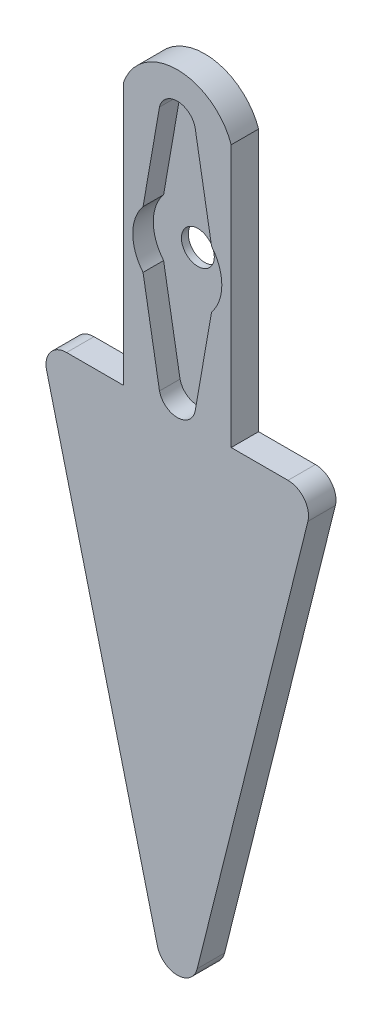
ISO-10303-21;
HEADER;
FILE_DESCRIPTION(('STEP AP214'),'2;1');
FILE_NAME('part.step','',(''),(''),'','','');
FILE_SCHEMA(('AUTOMOTIVE_DESIGN { 1 0 10303 214 1 1 1 1 }'));
ENDSEC;
DATA;
#1=APPLICATION_CONTEXT('core data for automotive mechanical design processes');
#2=APPLICATION_PROTOCOL_DEFINITION('international standard','automotive_design',2000,#1);
#3=PRODUCT_CONTEXT('',#1,'mechanical');
#4=PRODUCT('Part','Part','',(#3));
#5=PRODUCT_RELATED_PRODUCT_CATEGORY('part','',(#4));
#6=PRODUCT_DEFINITION_FORMATION('','',#4);
#7=PRODUCT_DEFINITION_CONTEXT('part definition',#1,'design');
#8=PRODUCT_DEFINITION('design','',#6,#7);
#9=PRODUCT_DEFINITION_SHAPE('','',#8);
#10=(LENGTH_UNIT() NAMED_UNIT(*) SI_UNIT(.MILLI.,.METRE.));
#11=(NAMED_UNIT(*) PLANE_ANGLE_UNIT() SI_UNIT($,.RADIAN.));
#12=(NAMED_UNIT(*) SI_UNIT($,.STERADIAN.) SOLID_ANGLE_UNIT());
#13=UNCERTAINTY_MEASURE_WITH_UNIT(LENGTH_MEASURE(1.E-05),#10,'distance_accuracy_value','');
#14=(GEOMETRIC_REPRESENTATION_CONTEXT(3) GLOBAL_UNCERTAINTY_ASSIGNED_CONTEXT((#13)) GLOBAL_UNIT_ASSIGNED_CONTEXT((#10,
#11,#12)) REPRESENTATION_CONTEXT('',''));
#15=CARTESIAN_POINT('',(0.,0.,0.));
#16=DIRECTION('',(0.,0.,1.));
#17=DIRECTION('',(1.,0.,0.));
#18=AXIS2_PLACEMENT_3D('',#15,#16,#17);
#19=CARTESIAN_POINT('',(0.,0.,4.));
#20=DIRECTION('',(0.,0.,-1.));
#21=DIRECTION('',(-1.,0.,0.));
#22=AXIS2_PLACEMENT_3D('',#19,#20,#21);
#23=CYLINDRICAL_SURFACE('',#22,6.5);
#24=DIRECTION('',(0.,0.,-1.));
#25=VECTOR('',#24,1.);
#26=CARTESIAN_POINT('',(4.99927103536296,4.15418934510465,4.));
#27=LINE('',#26,#25);
#28=CARTESIAN_POINT('',(4.99927103536296,4.15418934510465,4.));
#29=VERTEX_POINT('',#28);
#30=CARTESIAN_POINT('',(4.99927103536296,4.15418934510465,1.));
#31=VERTEX_POINT('',#30);
#32=EDGE_CURVE('E180',#29,#31,#27,.T.);
#33=ORIENTED_EDGE('',*,*,#32,.T.);
#34=CARTESIAN_POINT('',(0.,0.,1.));
#35=DIRECTION('',(0.,0.,-1.));
#36=DIRECTION('',(-1.,0.,0.));
#37=AXIS2_PLACEMENT_3D('',#34,#35,#36);
#38=CIRCLE('',#37,6.5);
#39=CARTESIAN_POINT('',(4.99927103536296,-4.15418934510465,1.));
#40=VERTEX_POINT('',#39);
#41=EDGE_CURVE('E197',#31,#40,#38,.T.);
#42=ORIENTED_EDGE('',*,*,#41,.T.);
#43=DIRECTION('',(0.,0.,-1.));
#44=VECTOR('',#43,1.);
#45=CARTESIAN_POINT('',(4.99927103536296,-4.15418934510465,4.));
#46=LINE('',#45,#44);
#47=CARTESIAN_POINT('',(4.99927103536296,-4.15418934510465,4.));
#48=VERTEX_POINT('',#47);
#49=EDGE_CURVE('E200',#48,#40,#46,.T.);
#50=ORIENTED_EDGE('',*,*,#49,.F.);
#51=CARTESIAN_POINT('',(0.,0.,4.));
#52=DIRECTION('',(0.,0.,1.));
#53=DIRECTION('',(1.,0.,0.));
#54=AXIS2_PLACEMENT_3D('',#51,#52,#53);
#55=CIRCLE('',#54,6.5);
#56=EDGE_CURVE('E357',#48,#29,#55,.T.);
#57=ORIENTED_EDGE('',*,*,#56,.T.);
#58=EDGE_LOOP('',(#33,#42,#50,#57));
#59=FACE_BOUND('',#58,.T.);
#60=ADVANCED_FACE('F41',(#59),#23,.F.);
#61=CARTESIAN_POINT('',(5.55395819963136,-0.96641337059102,4.));
#62=DIRECTION('',(-0.98519655140381,0.171428571428571,0.));
#63=DIRECTION('',(-0.171428571428571,-0.98519655140381,0.));
#64=AXIS2_PLACEMENT_3D('',#61,#62,#63);
#65=PLANE('',#64);
#66=ORIENTED_EDGE('',*,*,#49,.T.);
#67=DIRECTION('',(-0.171428571428571,-0.98519655140381,0.));
#68=VECTOR('',#67,1.);
#69=CARTESIAN_POINT('',(5.55395819963136,-0.96641337059102,1.));
#70=LINE('',#69,#68);
#71=CARTESIAN_POINT('',(2.6,-17.9427517196533,1.));
#72=VERTEX_POINT('',#71);
#73=EDGE_CURVE('E317',#40,#72,#70,.T.);
#74=ORIENTED_EDGE('',*,*,#73,.T.);
#75=DIRECTION('',(0.,0.,-1.));
#76=VECTOR('',#75,1.);
#77=CARTESIAN_POINT('',(2.6,-17.9427517196533,4.));
#78=LINE('',#77,#76);
#79=CARTESIAN_POINT('',(2.6,-17.9427517196533,4.));
#80=VERTEX_POINT('',#79);
#81=EDGE_CURVE('E207',#80,#72,#78,.T.);
#82=ORIENTED_EDGE('',*,*,#81,.F.);
#83=DIRECTION('',(0.171428571428571,0.98519655140381,0.));
#84=VECTOR('',#83,1.);
#85=CARTESIAN_POINT('',(5.55395819963136,-0.96641337059102,4.));
#86=LINE('',#85,#84);
#87=EDGE_CURVE('E361',#80,#48,#86,.T.);
#88=ORIENTED_EDGE('',*,*,#87,.T.);
#89=EDGE_LOOP('',(#66,#74,#82,#88));
#90=FACE_BOUND('',#89,.T.);
#91=ADVANCED_FACE('F387',(#90),#65,.T.);
#92=CARTESIAN_POINT('',(0.,-17.3284045022662,4.));
#93=DIRECTION('',(0.,0.,-1.));
#94=DIRECTION('',(-1.,0.,0.));
#95=AXIS2_PLACEMENT_3D('',#92,#93,#94);
#96=CYLINDRICAL_SURFACE('',#95,2.67159549773375);
#97=ORIENTED_EDGE('',*,*,#81,.T.);
#98=CARTESIAN_POINT('',(0.,-17.3284045022662,1.));
#99=DIRECTION('',(0.,0.,-1.));
#100=DIRECTION('',(-1.,0.,0.));
#101=AXIS2_PLACEMENT_3D('',#98,#99,#100);
#102=CIRCLE('',#101,2.67159549773375);
#103=CARTESIAN_POINT('',(-2.6,-17.9427517196533,1.));
#104=VERTEX_POINT('',#103);
#105=EDGE_CURVE('E390',#72,#104,#102,.T.);
#106=ORIENTED_EDGE('',*,*,#105,.T.);
#107=DIRECTION('',(0.,0.,-1.));
#108=VECTOR('',#107,1.);
#109=CARTESIAN_POINT('',(-2.6,-17.9427517196533,4.));
#110=LINE('',#109,#108);
#111=CARTESIAN_POINT('',(-2.6,-17.9427517196533,4.));
#112=VERTEX_POINT('',#111);
#113=EDGE_CURVE('E281',#112,#104,#110,.T.);
#114=ORIENTED_EDGE('',*,*,#113,.F.);
#115=CARTESIAN_POINT('',(0.,-17.3284045022662,4.));
#116=DIRECTION('',(0.,0.,1.));
#117=DIRECTION('',(1.,0.,0.));
#118=AXIS2_PLACEMENT_3D('',#115,#116,#117);
#119=CIRCLE('',#118,2.67159549773375);
#120=EDGE_CURVE('E365',#112,#80,#119,.T.);
#121=ORIENTED_EDGE('',*,*,#120,.T.);
#122=EDGE_LOOP('',(#97,#106,#114,#121));
#123=FACE_BOUND('',#122,.T.);
#124=ADVANCED_FACE('F418',(#123),#96,.F.);
#125=CARTESIAN_POINT('',(-5.55395819963136,-0.96641337059102,4.));
#126=DIRECTION('',(0.98519655140381,0.171428571428571,0.));
#127=DIRECTION('',(-0.171428571428571,0.98519655140381,0.));
#128=AXIS2_PLACEMENT_3D('',#125,#126,#127);
#129=PLANE('',#128);
#130=ORIENTED_EDGE('',*,*,#113,.T.);
#131=DIRECTION('',(-0.171428571428571,0.98519655140381,0.));
#132=VECTOR('',#131,1.);
#133=CARTESIAN_POINT('',(-5.55395819963136,-0.96641337059102,1.));
#134=LINE('',#133,#132);
#135=CARTESIAN_POINT('',(-4.99927103536296,-4.15418934510465,1.));
#136=VERTEX_POINT('',#135);
#137=EDGE_CURVE('E394',#104,#136,#134,.T.);
#138=ORIENTED_EDGE('',*,*,#137,.T.);
#139=DIRECTION('',(0.,0.,-1.));
#140=VECTOR('',#139,1.);
#141=CARTESIAN_POINT('',(-4.99927103536296,-4.15418934510465,4.));
#142=LINE('',#141,#140);
#143=CARTESIAN_POINT('',(-4.99927103536296,-4.15418934510465,4.));
#144=VERTEX_POINT('',#143);
#145=EDGE_CURVE('E277',#144,#136,#142,.T.);
#146=ORIENTED_EDGE('',*,*,#145,.F.);
#147=DIRECTION('',(0.171428571428571,-0.98519655140381,0.));
#148=VECTOR('',#147,1.);
#149=CARTESIAN_POINT('',(-5.55395819963136,-0.96641337059102,4.));
#150=LINE('',#149,#148);
#151=EDGE_CURVE('E369',#144,#112,#150,.T.);
#152=ORIENTED_EDGE('',*,*,#151,.T.);
#153=EDGE_LOOP('',(#130,#138,#146,#152));
#154=FACE_BOUND('',#153,.T.);
#155=ADVANCED_FACE('F519',(#154),#129,.T.);
#156=CARTESIAN_POINT('',(0.,0.,4.));
#157=DIRECTION('',(0.,0.,-1.));
#158=DIRECTION('',(-1.,0.,0.));
#159=AXIS2_PLACEMENT_3D('',#156,#157,#158);
#160=CYLINDRICAL_SURFACE('',#159,6.5);
#161=ORIENTED_EDGE('',*,*,#145,.T.);
#162=CARTESIAN_POINT('',(0.,0.,1.));
#163=DIRECTION('',(0.,0.,-1.));
#164=DIRECTION('',(-1.,0.,0.));
#165=AXIS2_PLACEMENT_3D('',#162,#163,#164);
#166=CIRCLE('',#165,6.5);
#167=CARTESIAN_POINT('',(-4.99927103536296,4.15418934510465,1.));
#168=VERTEX_POINT('',#167);
#169=EDGE_CURVE('E598',#136,#168,#166,.T.);
#170=ORIENTED_EDGE('',*,*,#169,.T.);
#171=DIRECTION('',(0.,0.,-1.));
#172=VECTOR('',#171,1.);
#173=CARTESIAN_POINT('',(-4.99927103536296,4.15418934510465,4.));
#174=LINE('',#173,#172);
#175=CARTESIAN_POINT('',(-4.99927103536296,4.15418934510465,4.));
#176=VERTEX_POINT('',#175);
#177=EDGE_CURVE('E273',#176,#168,#174,.T.);
#178=ORIENTED_EDGE('',*,*,#177,.F.);
#179=CARTESIAN_POINT('',(0.,0.,4.));
#180=DIRECTION('',(0.,0.,1.));
#181=DIRECTION('',(1.,0.,0.));
#182=AXIS2_PLACEMENT_3D('',#179,#180,#181);
#183=CIRCLE('',#182,6.5);
#184=EDGE_CURVE('E373',#176,#144,#183,.T.);
#185=ORIENTED_EDGE('',*,*,#184,.T.);
#186=EDGE_LOOP('',(#161,#170,#178,#185));
#187=FACE_BOUND('',#186,.T.);
#188=ADVANCED_FACE('F527',(#187),#160,.F.);
#189=CARTESIAN_POINT('',(-5.55395819963136,0.96641337059102,4.));
#190=DIRECTION('',(-0.98519655140381,0.171428571428571,0.));
#191=DIRECTION('',(-0.171428571428571,-0.98519655140381,0.));
#192=AXIS2_PLACEMENT_3D('',#189,#190,#191);
#193=PLANE('',#192);
#194=DIRECTION('',(-0.171428571428571,-0.98519655140381,0.));
#195=VECTOR('',#194,1.);
#196=CARTESIAN_POINT('',(-5.55395819963136,0.96641337059102,1.));
#197=LINE('',#196,#195);
#198=CARTESIAN_POINT('',(-2.6,17.9427517196533,1.));
#199=VERTEX_POINT('',#198);
#200=EDGE_CURVE('E190',#199,#168,#197,.T.);
#201=ORIENTED_EDGE('',*,*,#200,.F.);
#202=DIRECTION('',(0.,0.,-1.));
#203=VECTOR('',#202,1.);
#204=CARTESIAN_POINT('',(-2.6,17.9427517196533,4.));
#205=LINE('',#204,#203);
#206=CARTESIAN_POINT('',(-2.6,17.9427517196533,4.));
#207=VERTEX_POINT('',#206);
#208=EDGE_CURVE('E179',#207,#199,#205,.T.);
#209=ORIENTED_EDGE('',*,*,#208,.F.);
#210=DIRECTION('',(0.171428571428571,0.98519655140381,0.));
#211=VECTOR('',#210,1.);
#212=CARTESIAN_POINT('',(-5.55395819963136,0.96641337059102,4.));
#213=LINE('',#212,#211);
#214=EDGE_CURVE('E377',#176,#207,#213,.T.);
#215=ORIENTED_EDGE('',*,*,#214,.F.);
#216=ORIENTED_EDGE('',*,*,#177,.T.);
#217=EDGE_LOOP('',(#201,#209,#215,#216));
#218=FACE_BOUND('',#217,.T.);
#219=ADVANCED_FACE('F536',(#218),#193,.F.);
#220=CARTESIAN_POINT('',(0.,17.3284045022662,4.));
#221=DIRECTION('',(0.,0.,-1.));
#222=DIRECTION('',(-1.,0.,0.));
#223=AXIS2_PLACEMENT_3D('',#220,#221,#222);
#224=CYLINDRICAL_SURFACE('',#223,2.67159549773375);
#225=CARTESIAN_POINT('',(0.,17.3284045022662,1.));
#226=DIRECTION('',(0.,0.,-1.));
#227=DIRECTION('',(-1.,0.,0.));
#228=AXIS2_PLACEMENT_3D('',#225,#226,#227);
#229=CIRCLE('',#228,2.67159549773375);
#230=CARTESIAN_POINT('',(2.6,17.9427517196533,1.));
#231=VERTEX_POINT('',#230);
#232=EDGE_CURVE('E184',#231,#199,#229,.F.);
#233=ORIENTED_EDGE('',*,*,#232,.F.);
#234=DIRECTION('',(0.,0.,-1.));
#235=VECTOR('',#234,1.);
#236=CARTESIAN_POINT('',(2.6,17.9427517196533,4.));
#237=LINE('',#236,#235);
#238=CARTESIAN_POINT('',(2.6,17.9427517196533,4.));
#239=VERTEX_POINT('',#238);
#240=EDGE_CURVE('E168',#239,#231,#237,.T.);
#241=ORIENTED_EDGE('',*,*,#240,.F.);
#242=CARTESIAN_POINT('',(0.,17.3284045022662,4.));
#243=DIRECTION('',(0.,0.,1.));
#244=DIRECTION('',(1.,0.,0.));
#245=AXIS2_PLACEMENT_3D('',#242,#243,#244);
#246=CIRCLE('',#245,2.67159549773375);
#247=EDGE_CURVE('E380',#207,#239,#246,.F.);
#248=ORIENTED_EDGE('',*,*,#247,.F.);
#249=ORIENTED_EDGE('',*,*,#208,.T.);
#250=EDGE_LOOP('',(#233,#241,#248,#249));
#251=FACE_BOUND('',#250,.T.);
#252=ADVANCED_FACE('F185',(#251),#224,.F.);
#253=CARTESIAN_POINT('',(5.55395819963136,0.96641337059102,4.));
#254=DIRECTION('',(0.98519655140381,0.171428571428571,0.));
#255=DIRECTION('',(-0.171428571428571,0.98519655140381,0.));
#256=AXIS2_PLACEMENT_3D('',#253,#254,#255);
#257=PLANE('',#256);
#258=DIRECTION('',(-0.171428571428571,0.98519655140381,0.));
#259=VECTOR('',#258,1.);
#260=CARTESIAN_POINT('',(5.55395819963136,0.96641337059102,1.));
#261=LINE('',#260,#259);
#262=EDGE_CURVE('E173',#31,#231,#261,.T.);
#263=ORIENTED_EDGE('',*,*,#262,.F.);
#264=ORIENTED_EDGE('',*,*,#32,.F.);
#265=DIRECTION('',(0.171428571428571,-0.98519655140381,0.));
#266=VECTOR('',#265,1.);
#267=CARTESIAN_POINT('',(5.55395819963136,0.96641337059102,4.));
#268=LINE('',#267,#266);
#269=EDGE_CURVE('E175',#239,#29,#268,.T.);
#270=ORIENTED_EDGE('',*,*,#269,.F.);
#271=ORIENTED_EDGE('',*,*,#240,.T.);
#272=EDGE_LOOP('',(#263,#264,#270,#271));
#273=FACE_BOUND('',#272,.T.);
#274=ADVANCED_FACE('F170',(#273),#257,.F.);
#275=CARTESIAN_POINT('',(0.,15.6414839126163,4.));
#276=DIRECTION('',(0.,0.,-1.));
#277=DIRECTION('',(-1.,0.,0.));
#278=AXIS2_PLACEMENT_3D('',#275,#276,#277);
#279=CYLINDRICAL_SURFACE('',#278,8.33979200193729);
#280=CARTESIAN_POINT('',(0.,15.6414839126163,0.));
#281=DIRECTION('',(0.,0.,1.));
#282=DIRECTION('',(1.,0.,0.));
#283=AXIS2_PLACEMENT_3D('',#280,#281,#282);
#284=CIRCLE('',#283,8.33979200193729);
#285=CARTESIAN_POINT('',(-7.8674436728674,18.4083342319932,0.));
#286=VERTEX_POINT('',#285);
#287=CARTESIAN_POINT('',(7.8674436728674,18.4083342319932,0.));
#288=VERTEX_POINT('',#287);
#289=EDGE_CURVE('E309',#286,#288,#284,.F.);
#290=ORIENTED_EDGE('',*,*,#289,.F.);
#291=DIRECTION('',(0.,0.,-1.));
#292=VECTOR('',#291,1.);
#293=CARTESIAN_POINT('',(-7.8674436728674,18.4083342319932,4.));
#294=LINE('',#293,#292);
#295=CARTESIAN_POINT('',(-7.8674436728674,18.4083342319932,4.));
#296=VERTEX_POINT('',#295);
#297=EDGE_CURVE('E210',#296,#286,#294,.T.);
#298=ORIENTED_EDGE('',*,*,#297,.F.);
#299=CARTESIAN_POINT('',(0.,15.6414839126163,4.));
#300=DIRECTION('',(0.,0.,1.));
#301=DIRECTION('',(1.,0.,0.));
#302=AXIS2_PLACEMENT_3D('',#299,#300,#301);
#303=CIRCLE('',#302,8.33979200193729);
#304=CARTESIAN_POINT('',(7.8674436728674,18.4083342319932,4.));
#305=VERTEX_POINT('',#304);
#306=EDGE_CURVE('E263',#296,#305,#303,.F.);
#307=ORIENTED_EDGE('',*,*,#306,.T.);
#308=DIRECTION('',(0.,0.,-1.));
#309=VECTOR('',#308,1.);
#310=CARTESIAN_POINT('',(7.8674436728674,18.4083342319932,4.));
#311=LINE('',#310,#309);
#312=EDGE_CURVE('E288',#305,#288,#311,.T.);
#313=ORIENTED_EDGE('',*,*,#312,.T.);
#314=EDGE_LOOP('',(#290,#298,#307,#313));
#315=FACE_BOUND('',#314,.T.);
#316=ADVANCED_FACE('F313',(#315),#279,.T.);
#317=CARTESIAN_POINT('',(-7.8674436728674,0.,4.));
#318=DIRECTION('',(1.,0.,0.));
#319=DIRECTION('',(0.,1.,0.));
#320=AXIS2_PLACEMENT_3D('',#317,#318,#319);
#321=PLANE('',#320);
#322=DIRECTION('',(0.,-1.,0.));
#323=VECTOR('',#322,1.);
#324=CARTESIAN_POINT('',(-7.8674436728674,0.,0.));
#325=LINE('',#324,#323);
#326=CARTESIAN_POINT('',(-7.86744367286739,-19.8566714377293,0.));
#327=VERTEX_POINT('',#326);
#328=EDGE_CURVE('E303',#286,#327,#325,.T.);
#329=ORIENTED_EDGE('',*,*,#328,.T.);
#330=DIRECTION('',(0.,0.,-1.));
#331=VECTOR('',#330,1.);
#332=CARTESIAN_POINT('',(-7.86744367286739,-19.8566714377293,4.));
#333=LINE('',#332,#331);
#334=CARTESIAN_POINT('',(-7.86744367286739,-19.8566714377293,4.));
#335=VERTEX_POINT('',#334);
#336=EDGE_CURVE('E293',#335,#327,#333,.T.);
#337=ORIENTED_EDGE('',*,*,#336,.F.);
#338=DIRECTION('',(0.,-1.,0.));
#339=VECTOR('',#338,1.);
#340=CARTESIAN_POINT('',(-7.8674436728674,0.,4.));
#341=LINE('',#340,#339);
#342=EDGE_CURVE('E304',#296,#335,#341,.T.);
#343=ORIENTED_EDGE('',*,*,#342,.F.);
#344=ORIENTED_EDGE('',*,*,#297,.T.);
#345=EDGE_LOOP('',(#329,#337,#343,#344));
#346=FACE_BOUND('',#345,.T.);
#347=ADVANCED_FACE('F302',(#346),#321,.F.);
#348=CARTESIAN_POINT('',(0.,-19.8566714377293,4.));
#349=DIRECTION('',(0.,-1.,0.));
#350=DIRECTION('',(0.,0.,-1.));
#351=AXIS2_PLACEMENT_3D('',#348,#349,#350);
#352=PLANE('',#351);
#353=DIRECTION('',(-1.,0.,0.));
#354=VECTOR('',#353,1.);
#355=CARTESIAN_POINT('',(0.,-19.8566714377293,0.));
#356=LINE('',#355,#354);
#357=CARTESIAN_POINT('',(-16.1576707807868,-19.8566714377293,0.));
#358=VERTEX_POINT('',#357);
#359=EDGE_CURVE('E310',#327,#358,#356,.T.);
#360=ORIENTED_EDGE('',*,*,#359,.T.);
#361=DIRECTION('',(0.,0.,-1.));
#362=VECTOR('',#361,1.);
#363=CARTESIAN_POINT('',(-16.1576707807868,-19.8566714377293,4.));
#364=LINE('',#363,#362);
#365=CARTESIAN_POINT('',(-16.1576707807868,-19.8566714377293,4.));
#366=VERTEX_POINT('',#365);
#367=EDGE_CURVE('E11',#358,#366,#364,.F.);
#368=ORIENTED_EDGE('',*,*,#367,.T.);
#369=DIRECTION('',(-1.,0.,0.));
#370=VECTOR('',#369,1.);
#371=CARTESIAN_POINT('',(0.,-19.8566714377293,4.));
#372=LINE('',#371,#370);
#373=EDGE_CURVE('E350',#335,#366,#372,.T.);
#374=ORIENTED_EDGE('',*,*,#373,.F.);
#375=ORIENTED_EDGE('',*,*,#336,.T.);
#376=EDGE_LOOP('',(#360,#368,#374,#375));
#377=FACE_BOUND('',#376,.T.);
#378=ADVANCED_FACE('F404',(#377),#352,.F.);
#379=CARTESIAN_POINT('',(-23.4956873971128,-5.87392184927819,4.));
#380=DIRECTION('',(0.970142500145332,0.242535625036333,0.));
#381=DIRECTION('',(-0.242535625036333,0.970142500145332,0.));
#382=AXIS2_PLACEMENT_3D('',#379,#380,#381);
#383=PLANE('',#382);
#384=DIRECTION('',(0.242535625036333,-0.970142500145332,0.));
#385=VECTOR('',#384,1.);
#386=CARTESIAN_POINT('',(-23.4956873971128,-5.87392184927819,0.));
#387=LINE('',#386,#385);
#388=CARTESIAN_POINT('',(-19.0680982812227,-23.5842783128383,0.));
#389=VERTEX_POINT('',#388);
#390=CARTESIAN_POINT('',(-2.91042750043599,-88.2149614359853,0.));
#391=VERTEX_POINT('',#390);
#392=EDGE_CURVE('E265',#389,#391,#387,.T.);
#393=ORIENTED_EDGE('',*,*,#392,.T.);
#394=DIRECTION('',(0.,0.,-1.));
#395=VECTOR('',#394,1.);
#396=CARTESIAN_POINT('',(-2.910427500436,-88.2149614359853,4.));
#397=LINE('',#396,#395);
#398=CARTESIAN_POINT('',(-2.91042750043599,-88.2149614359853,4.));
#399=VERTEX_POINT('',#398);
#400=EDGE_CURVE('E229',#391,#399,#397,.F.);
#401=ORIENTED_EDGE('',*,*,#400,.T.);
#402=DIRECTION('',(0.242535625036333,-0.970142500145332,0.));
#403=VECTOR('',#402,1.);
#404=CARTESIAN_POINT('',(-23.4956873971128,-5.87392184927819,4.));
#405=LINE('',#404,#403);
#406=CARTESIAN_POINT('',(-19.0680982812227,-23.5842783128383,4.));
#407=VERTEX_POINT('',#406);
#408=EDGE_CURVE('E340',#407,#399,#405,.T.);
#409=ORIENTED_EDGE('',*,*,#408,.F.);
#410=DIRECTION('',(0.,0.,-1.));
#411=VECTOR('',#410,1.);
#412=CARTESIAN_POINT('',(-19.0680982812227,-23.5842783128383,4.));
#413=LINE('',#412,#411);
#414=EDGE_CURVE('E225',#407,#389,#413,.T.);
#415=ORIENTED_EDGE('',*,*,#414,.T.);
#416=EDGE_LOOP('',(#393,#401,#409,#415));
#417=FACE_BOUND('',#416,.T.);
#418=ADVANCED_FACE('F328',(#417),#383,.F.);
#419=CARTESIAN_POINT('',(23.4956873971128,-5.87392184927819,4.));
#420=DIRECTION('',(0.970142500145332,-0.242535625036333,0.));
#421=DIRECTION('',(0.242535625036333,0.970142500145332,0.));
#422=AXIS2_PLACEMENT_3D('',#419,#420,#421);
#423=PLANE('',#422);
#424=DIRECTION('',(-0.242535625036333,-0.970142500145332,0.));
#425=VECTOR('',#424,1.);
#426=CARTESIAN_POINT('',(23.4956873971128,-5.87392184927819,4.));
#427=LINE('',#426,#425);
#428=CARTESIAN_POINT('',(19.0680982812227,-23.5842783128383,4.));
#429=VERTEX_POINT('',#428);
#430=CARTESIAN_POINT('',(2.91042750043599,-88.2149614359853,4.));
#431=VERTEX_POINT('',#430);
#432=EDGE_CURVE('E339',#429,#431,#427,.T.);
#433=ORIENTED_EDGE('',*,*,#432,.T.);
#434=DIRECTION('',(0.,0.,-1.));
#435=VECTOR('',#434,1.);
#436=CARTESIAN_POINT('',(2.910427500436,-88.2149614359853,0.));
#437=LINE('',#436,#435);
#438=CARTESIAN_POINT('',(2.91042750043599,-88.2149614359853,0.));
#439=VERTEX_POINT('',#438);
#440=EDGE_CURVE('E204',#431,#439,#437,.T.);
#441=ORIENTED_EDGE('',*,*,#440,.T.);
#442=DIRECTION('',(-0.242535625036333,-0.970142500145332,0.));
#443=VECTOR('',#442,1.);
#444=CARTESIAN_POINT('',(23.4956873971128,-5.87392184927819,0.));
#445=LINE('',#444,#443);
#446=CARTESIAN_POINT('',(19.0680982812227,-23.5842783128383,0.));
#447=VERTEX_POINT('',#446);
#448=EDGE_CURVE('E259',#447,#439,#445,.T.);
#449=ORIENTED_EDGE('',*,*,#448,.F.);
#450=DIRECTION('',(0.,0.,-1.));
#451=VECTOR('',#450,1.);
#452=CARTESIAN_POINT('',(19.0680982812227,-23.5842783128383,4.));
#453=LINE('',#452,#451);
#454=EDGE_CURVE('E199',#447,#429,#453,.F.);
#455=ORIENTED_EDGE('',*,*,#454,.T.);
#456=EDGE_LOOP('',(#433,#441,#449,#455));
#457=FACE_BOUND('',#456,.T.);
#458=ADVANCED_FACE('F342',(#457),#423,.T.);
#459=CARTESIAN_POINT('',(0.,-19.8566714377293,4.));
#460=DIRECTION('',(0.,1.,0.));
#461=DIRECTION('',(0.,0.,1.));
#462=AXIS2_PLACEMENT_3D('',#459,#460,#461);
#463=PLANE('',#462);
#464=DIRECTION('',(1.,0.,0.));
#465=VECTOR('',#464,1.);
#466=CARTESIAN_POINT('',(0.,-19.8566714377293,4.));
#467=LINE('',#466,#465);
#468=CARTESIAN_POINT('',(7.86744367286739,-19.8566714377293,4.));
#469=VERTEX_POINT('',#468);
#470=CARTESIAN_POINT('',(16.1576707807867,-19.8566714377293,4.));
#471=VERTEX_POINT('',#470);
#472=EDGE_CURVE('E248',#469,#471,#467,.T.);
#473=ORIENTED_EDGE('',*,*,#472,.T.);
#474=DIRECTION('',(0.,0.,-1.));
#475=VECTOR('',#474,1.);
#476=CARTESIAN_POINT('',(16.1576707807867,-19.8566714377293,4.));
#477=LINE('',#476,#475);
#478=CARTESIAN_POINT('',(16.1576707807867,-19.8566714377293,0.));
#479=VERTEX_POINT('',#478);
#480=EDGE_CURVE('E50',#471,#479,#477,.T.);
#481=ORIENTED_EDGE('',*,*,#480,.T.);
#482=DIRECTION('',(1.,0.,0.));
#483=VECTOR('',#482,1.);
#484=CARTESIAN_POINT('',(0.,-19.8566714377293,0.));
#485=LINE('',#484,#483);
#486=CARTESIAN_POINT('',(7.86744367286739,-19.8566714377293,0.));
#487=VERTEX_POINT('',#486);
#488=EDGE_CURVE('E246',#487,#479,#485,.T.);
#489=ORIENTED_EDGE('',*,*,#488,.F.);
#490=DIRECTION('',(0.,0.,-1.));
#491=VECTOR('',#490,1.);
#492=CARTESIAN_POINT('',(7.86744367286739,-19.8566714377293,4.));
#493=LINE('',#492,#491);
#494=EDGE_CURVE('E291',#469,#487,#493,.T.);
#495=ORIENTED_EDGE('',*,*,#494,.F.);
#496=EDGE_LOOP('',(#473,#481,#489,#495));
#497=FACE_BOUND('',#496,.T.);
#498=ADVANCED_FACE('F245',(#497),#463,.T.);
#499=CARTESIAN_POINT('',(7.8674436728674,0.,4.));
#500=DIRECTION('',(1.,0.,0.));
#501=DIRECTION('',(0.,1.,0.));
#502=AXIS2_PLACEMENT_3D('',#499,#500,#501);
#503=PLANE('',#502);
#504=DIRECTION('',(0.,-1.,0.));
#505=VECTOR('',#504,1.);
#506=CARTESIAN_POINT('',(7.8674436728674,0.,0.));
#507=LINE('',#506,#505);
#508=EDGE_CURVE('E257',#288,#487,#507,.T.);
#509=ORIENTED_EDGE('',*,*,#508,.F.);
#510=ORIENTED_EDGE('',*,*,#312,.F.);
#511=DIRECTION('',(0.,-1.,0.));
#512=VECTOR('',#511,1.);
#513=CARTESIAN_POINT('',(7.8674436728674,0.,4.));
#514=LINE('',#513,#512);
#515=EDGE_CURVE('E348',#305,#469,#514,.T.);
#516=ORIENTED_EDGE('',*,*,#515,.T.);
#517=ORIENTED_EDGE('',*,*,#494,.T.);
#518=EDGE_LOOP('',(#509,#510,#516,#517));
#519=FACE_BOUND('',#518,.T.);
#520=ADVANCED_FACE('F422',(#519),#503,.T.);
#521=CARTESIAN_POINT('',(0.,0.,4.));
#522=DIRECTION('',(0.,0.,1.));
#523=DIRECTION('',(1.,0.,0.));
#524=AXIS2_PLACEMENT_3D('',#521,#522,#523);
#525=PLANE('',#524);
#526=ORIENTED_EDGE('',*,*,#408,.T.);
#527=CARTESIAN_POINT('',(0.,-87.4873545608763,4.));
#528=DIRECTION('',(0.,0.,1.));
#529=DIRECTION('',(1.,0.,0.));
#530=AXIS2_PLACEMENT_3D('',#527,#528,#529);
#531=CIRCLE('',#530,3.);
#532=EDGE_CURVE('E237',#399,#431,#531,.T.);
#533=ORIENTED_EDGE('',*,*,#532,.T.);
#534=ORIENTED_EDGE('',*,*,#432,.F.);
#535=CARTESIAN_POINT('',(16.1576707807867,-22.8566714377293,4.));
#536=DIRECTION('',(0.,0.,1.));
#537=DIRECTION('',(1.,0.,0.));
#538=AXIS2_PLACEMENT_3D('',#535,#536,#537);
#539=CIRCLE('',#538,3.);
#540=EDGE_CURVE('E57',#429,#471,#539,.T.);
#541=ORIENTED_EDGE('',*,*,#540,.T.);
#542=ORIENTED_EDGE('',*,*,#472,.F.);
#543=ORIENTED_EDGE('',*,*,#515,.F.);
#544=ORIENTED_EDGE('',*,*,#306,.F.);
#545=ORIENTED_EDGE('',*,*,#342,.T.);
#546=ORIENTED_EDGE('',*,*,#373,.T.);
#547=CARTESIAN_POINT('',(-16.1576707807868,-22.8566714377293,4.));
#548=DIRECTION('',(0.,0.,1.));
#549=DIRECTION('',(1.,0.,0.));
#550=AXIS2_PLACEMENT_3D('',#547,#548,#549);
#551=CIRCLE('',#550,3.);
#552=EDGE_CURVE('E232',#366,#407,#551,.T.);
#553=ORIENTED_EDGE('',*,*,#552,.T.);
#554=EDGE_LOOP('',(#526,#533,#534,#541,#542,#543,#544,#545,#546,#553));
#555=FACE_BOUND('',#554,.T.);
#556=ORIENTED_EDGE('',*,*,#56,.F.);
#557=ORIENTED_EDGE('',*,*,#87,.F.);
#558=ORIENTED_EDGE('',*,*,#120,.F.);
#559=ORIENTED_EDGE('',*,*,#151,.F.);
#560=ORIENTED_EDGE('',*,*,#184,.F.);
#561=ORIENTED_EDGE('',*,*,#214,.T.);
#562=ORIENTED_EDGE('',*,*,#247,.T.);
#563=ORIENTED_EDGE('',*,*,#269,.T.);
#564=EDGE_LOOP('',(#556,#557,#558,#559,#560,#561,#562,#563));
#565=FACE_BOUND('',#564,.T.);
#566=ADVANCED_FACE('F337',(#555,#565),#525,.T.);
#567=CARTESIAN_POINT('',(0.,0.,0.));
#568=DIRECTION('',(0.,0.,1.));
#569=DIRECTION('',(1.,0.,0.));
#570=AXIS2_PLACEMENT_3D('',#567,#568,#569);
#571=PLANE('',#570);
#572=ORIENTED_EDGE('',*,*,#448,.T.);
#573=CARTESIAN_POINT('',(0.,-87.4873545608763,0.));
#574=DIRECTION('',(0.,0.,1.));
#575=DIRECTION('',(1.,0.,0.));
#576=AXIS2_PLACEMENT_3D('',#573,#574,#575);
#577=CIRCLE('',#576,3.);
#578=EDGE_CURVE('E222',#439,#391,#577,.F.);
#579=ORIENTED_EDGE('',*,*,#578,.T.);
#580=ORIENTED_EDGE('',*,*,#392,.F.);
#581=CARTESIAN_POINT('',(-16.1576707807868,-22.8566714377293,0.));
#582=DIRECTION('',(0.,0.,1.));
#583=DIRECTION('',(1.,0.,0.));
#584=AXIS2_PLACEMENT_3D('',#581,#582,#583);
#585=CIRCLE('',#584,3.);
#586=EDGE_CURVE('E216',#389,#358,#585,.F.);
#587=ORIENTED_EDGE('',*,*,#586,.T.);
#588=ORIENTED_EDGE('',*,*,#359,.F.);
#589=ORIENTED_EDGE('',*,*,#328,.F.);
#590=ORIENTED_EDGE('',*,*,#289,.T.);
#591=ORIENTED_EDGE('',*,*,#508,.T.);
#592=ORIENTED_EDGE('',*,*,#488,.T.);
#593=CARTESIAN_POINT('',(16.1576707807867,-22.8566714377293,0.));
#594=DIRECTION('',(0.,0.,1.));
#595=DIRECTION('',(1.,0.,0.));
#596=AXIS2_PLACEMENT_3D('',#593,#594,#595);
#597=CIRCLE('',#596,3.);
#598=EDGE_CURVE('E219',#479,#447,#597,.F.);
#599=ORIENTED_EDGE('',*,*,#598,.T.);
#600=EDGE_LOOP('',(#572,#579,#580,#587,#588,#589,#590,#591,#592,#599));
#601=FACE_BOUND('',#600,.T.);
#602=CARTESIAN_POINT('',(0.,0.,0.));
#603=DIRECTION('',(0.,0.,1.));
#604=DIRECTION('',(1.,0.,0.));
#605=AXIS2_PLACEMENT_3D('',#602,#603,#604);
#606=CIRCLE('',#605,2.4);
#607=CARTESIAN_POINT('',(2.4,0.,0.));
#608=VERTEX_POINT('',#607);
#609=EDGE_CURVE('E607',#608,#608,#606,.T.);
#610=ORIENTED_EDGE('',*,*,#609,.T.);
#611=EDGE_LOOP('',(#610));
#612=FACE_BOUND('',#611,.T.);
#613=ADVANCED_FACE('F252',(#601,#612),#571,.F.);
#614=CARTESIAN_POINT('',(-3.35878376819331,16.8425116072897,1.));
#615=DIRECTION('',(0.,0.,-1.));
#616=DIRECTION('',(-1.,0.,0.));
#617=AXIS2_PLACEMENT_3D('',#614,#615,#616);
#618=PLANE('',#617);
#619=ORIENTED_EDGE('',*,*,#41,.F.);
#620=ORIENTED_EDGE('',*,*,#262,.T.);
#621=ORIENTED_EDGE('',*,*,#232,.T.);
#622=ORIENTED_EDGE('',*,*,#200,.T.);
#623=ORIENTED_EDGE('',*,*,#169,.F.);
#624=ORIENTED_EDGE('',*,*,#137,.F.);
#625=ORIENTED_EDGE('',*,*,#105,.F.);
#626=ORIENTED_EDGE('',*,*,#73,.F.);
#627=EDGE_LOOP('',(#619,#620,#621,#622,#623,#624,#625,#626));
#628=FACE_BOUND('',#627,.T.);
#629=CARTESIAN_POINT('',(0.,0.,1.));
#630=DIRECTION('',(0.,0.,1.));
#631=DIRECTION('',(1.,0.,0.));
#632=AXIS2_PLACEMENT_3D('',#629,#630,#631);
#633=CIRCLE('',#632,2.4);
#634=CARTESIAN_POINT('',(2.4,0.,1.));
#635=VERTEX_POINT('',#634);
#636=EDGE_CURVE('E191',#635,#635,#633,.T.);
#637=ORIENTED_EDGE('',*,*,#636,.F.);
#638=EDGE_LOOP('',(#637));
#639=FACE_BOUND('',#638,.T.);
#640=ADVANCED_FACE('F194',(#628,#639),#618,.F.);
#641=CARTESIAN_POINT('',(0.,0.,1.));
#642=DIRECTION('',(0.,0.,-1.));
#643=DIRECTION('',(-1.,0.,0.));
#644=AXIS2_PLACEMENT_3D('',#641,#642,#643);
#645=CYLINDRICAL_SURFACE('',#644,2.4);
#646=ORIENTED_EDGE('',*,*,#636,.T.);
#647=EDGE_LOOP('',(#646));
#648=FACE_BOUND('',#647,.T.);
#649=ORIENTED_EDGE('',*,*,#609,.F.);
#650=EDGE_LOOP('',(#649));
#651=FACE_BOUND('',#650,.T.);
#652=ADVANCED_FACE('F461',(#648,#651),#645,.F.);
#653=CARTESIAN_POINT('',(0.,-87.4873545608763,4.));
#654=DIRECTION('',(0.,0.,1.));
#655=DIRECTION('',(1.,0.,0.));
#656=AXIS2_PLACEMENT_3D('',#653,#654,#655);
#657=CYLINDRICAL_SURFACE('',#656,3.);
#658=ORIENTED_EDGE('',*,*,#532,.F.);
#659=ORIENTED_EDGE('',*,*,#400,.F.);
#660=ORIENTED_EDGE('',*,*,#578,.F.);
#661=ORIENTED_EDGE('',*,*,#440,.F.);
#662=EDGE_LOOP('',(#658,#659,#660,#661));
#663=FACE_BOUND('',#662,.T.);
#664=ADVANCED_FACE('F334',(#663),#657,.T.);
#665=CARTESIAN_POINT('',(16.1576707807867,-22.8566714377293,4.));
#666=DIRECTION('',(0.,0.,-1.));
#667=DIRECTION('',(-1.,0.,0.));
#668=AXIS2_PLACEMENT_3D('',#665,#666,#667);
#669=CYLINDRICAL_SURFACE('',#668,3.);
#670=ORIENTED_EDGE('',*,*,#540,.F.);
#671=ORIENTED_EDGE('',*,*,#454,.F.);
#672=ORIENTED_EDGE('',*,*,#598,.F.);
#673=ORIENTED_EDGE('',*,*,#480,.F.);
#674=EDGE_LOOP('',(#670,#671,#672,#673));
#675=FACE_BOUND('',#674,.T.);
#676=ADVANCED_FACE('F475',(#675),#669,.T.);
#677=CARTESIAN_POINT('',(-16.1576707807868,-22.8566714377293,4.));
#678=DIRECTION('',(0.,0.,-1.));
#679=DIRECTION('',(-1.,0.,0.));
#680=AXIS2_PLACEMENT_3D('',#677,#678,#679);
#681=CYLINDRICAL_SURFACE('',#680,3.);
#682=ORIENTED_EDGE('',*,*,#552,.F.);
#683=ORIENTED_EDGE('',*,*,#367,.F.);
#684=ORIENTED_EDGE('',*,*,#586,.F.);
#685=ORIENTED_EDGE('',*,*,#414,.F.);
#686=EDGE_LOOP('',(#682,#683,#684,#685));
#687=FACE_BOUND('',#686,.T.);
#688=ADVANCED_FACE('F43',(#687),#681,.T.);
#689=CLOSED_SHELL('',(#60,#91,#124,#155,#188,#219,#252,#274,#316,#347,#378,#418,#458,#498,#520,
#566,#613,#640,#652,#664,#676,#688));
#690=MANIFOLD_SOLID_BREP('B2',#689);
#691=ADVANCED_BREP_SHAPE_REPRESENTATION('',(#18,#690),#14);
#692=SHAPE_DEFINITION_REPRESENTATION(#9,#691);
ENDSEC;
END-ISO-10303-21;
